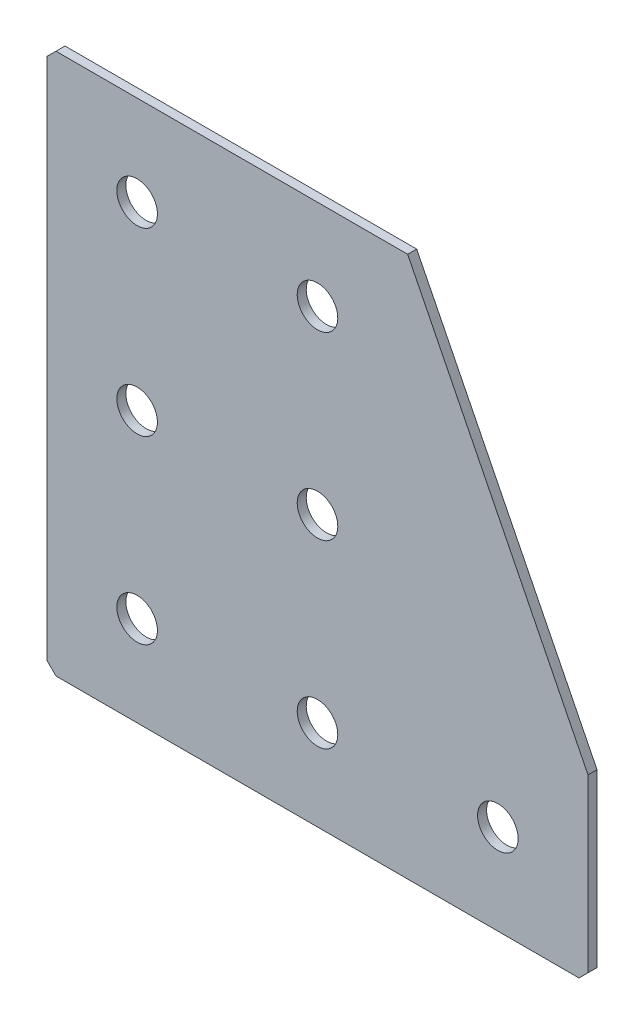
ISO-10303-21;
HEADER;
FILE_DESCRIPTION(('STEP AP214'),'2;1');
FILE_NAME('part.step','',(''),(''),'','','');
FILE_SCHEMA(('AUTOMOTIVE_DESIGN { 1 0 10303 214 1 1 1 1 }'));
ENDSEC;
DATA;
#1=APPLICATION_CONTEXT('core data for automotive mechanical design processes');
#2=APPLICATION_PROTOCOL_DEFINITION('international standard','automotive_design',2000,#1);
#3=PRODUCT_CONTEXT('',#1,'mechanical');
#4=PRODUCT('Part','Part','',(#3));
#5=PRODUCT_RELATED_PRODUCT_CATEGORY('part','',(#4));
#6=PRODUCT_DEFINITION_FORMATION('','',#4);
#7=PRODUCT_DEFINITION_CONTEXT('part definition',#1,'design');
#8=PRODUCT_DEFINITION('design','',#6,#7);
#9=PRODUCT_DEFINITION_SHAPE('','',#8);
#10=(LENGTH_UNIT() NAMED_UNIT(*) SI_UNIT(.MILLI.,.METRE.));
#11=(NAMED_UNIT(*) PLANE_ANGLE_UNIT() SI_UNIT($,.RADIAN.));
#12=(NAMED_UNIT(*) SI_UNIT($,.STERADIAN.) SOLID_ANGLE_UNIT());
#13=UNCERTAINTY_MEASURE_WITH_UNIT(LENGTH_MEASURE(1.E-05),#10,'distance_accuracy_value','');
#14=(GEOMETRIC_REPRESENTATION_CONTEXT(3) GLOBAL_UNCERTAINTY_ASSIGNED_CONTEXT((#13)) GLOBAL_UNIT_ASSIGNED_CONTEXT((#10,
#11,#12)) REPRESENTATION_CONTEXT('',''));
#15=CARTESIAN_POINT('',(0.,0.,0.));
#16=DIRECTION('',(0.,0.,1.));
#17=DIRECTION('',(1.,0.,0.));
#18=AXIS2_PLACEMENT_3D('',#15,#16,#17);
#19=CARTESIAN_POINT('',(80.,0.,-2.));
#20=DIRECTION('',(0.,-1.,0.));
#21=DIRECTION('',(1.,0.,0.));
#22=AXIS2_PLACEMENT_3D('',#19,#20,#21);
#23=PLANE('',#22);
#24=DIRECTION('',(1.,0.,0.));
#25=VECTOR('',#24,1.);
#26=CARTESIAN_POINT('',(80.,0.,-2.));
#27=LINE('',#26,#25);
#28=CARTESIAN_POINT('',(2.,0.,-2.));
#29=VERTEX_POINT('',#28);
#30=CARTESIAN_POINT('',(80.,0.,-2.));
#31=VERTEX_POINT('',#30);
#32=EDGE_CURVE('E101',#29,#31,#27,.T.);
#33=ORIENTED_EDGE('',*,*,#32,.F.);
#34=DIRECTION('',(0.,0.,1.));
#35=VECTOR('',#34,1.);
#36=CARTESIAN_POINT('',(2.,0.,-2.));
#37=LINE('',#36,#35);
#38=CARTESIAN_POINT('',(2.,0.,0.));
#39=VERTEX_POINT('',#38);
#40=EDGE_CURVE('E127',#29,#39,#37,.T.);
#41=ORIENTED_EDGE('',*,*,#40,.T.);
#42=DIRECTION('',(1.,0.,0.));
#43=VECTOR('',#42,1.);
#44=CARTESIAN_POINT('',(80.,0.,0.));
#45=LINE('',#44,#43);
#46=CARTESIAN_POINT('',(80.,0.,0.));
#47=VERTEX_POINT('',#46);
#48=EDGE_CURVE('E125',#39,#47,#45,.T.);
#49=ORIENTED_EDGE('',*,*,#48,.T.);
#50=DIRECTION('',(0.,0.,1.));
#51=VECTOR('',#50,1.);
#52=CARTESIAN_POINT('',(80.,0.,-2.));
#53=LINE('',#52,#51);
#54=EDGE_CURVE('E118',#31,#47,#53,.T.);
#55=ORIENTED_EDGE('',*,*,#54,.F.);
#56=EDGE_LOOP('',(#33,#41,#49,#55));
#57=FACE_BOUND('',#56,.T.);
#58=ADVANCED_FACE('F37',(#57),#23,.F.);
#59=CARTESIAN_POINT('',(120.,-80.,-2.));
#60=DIRECTION('',(-0.894427190999916,-0.447213595499958,0.));
#61=DIRECTION('',(0.447213595499958,-0.894427190999916,0.));
#62=AXIS2_PLACEMENT_3D('',#59,#60,#61);
#63=PLANE('',#62);
#64=DIRECTION('',(0.447213595499958,-0.894427190999916,0.));
#65=VECTOR('',#64,1.);
#66=CARTESIAN_POINT('',(120.,-80.,0.));
#67=LINE('',#66,#65);
#68=CARTESIAN_POINT('',(120.,-80.,0.));
#69=VERTEX_POINT('',#68);
#70=EDGE_CURVE('E164',#47,#69,#67,.T.);
#71=ORIENTED_EDGE('',*,*,#70,.T.);
#72=DIRECTION('',(0.,0.,1.));
#73=VECTOR('',#72,1.);
#74=CARTESIAN_POINT('',(120.,-80.,-2.));
#75=LINE('',#74,#73);
#76=CARTESIAN_POINT('',(120.,-80.,-2.));
#77=VERTEX_POINT('',#76);
#78=EDGE_CURVE('E120',#77,#69,#75,.T.);
#79=ORIENTED_EDGE('',*,*,#78,.F.);
#80=DIRECTION('',(0.447213595499958,-0.894427190999916,0.));
#81=VECTOR('',#80,1.);
#82=CARTESIAN_POINT('',(120.,-80.,-2.));
#83=LINE('',#82,#81);
#84=EDGE_CURVE('E105',#31,#77,#83,.T.);
#85=ORIENTED_EDGE('',*,*,#84,.F.);
#86=ORIENTED_EDGE('',*,*,#54,.T.);
#87=EDGE_LOOP('',(#71,#79,#85,#86));
#88=FACE_BOUND('',#87,.T.);
#89=ADVANCED_FACE('F117',(#88),#63,.F.);
#90=CARTESIAN_POINT('',(120.,-120.,-2.));
#91=DIRECTION('',(-1.,0.,0.));
#92=DIRECTION('',(0.,0.,1.));
#93=AXIS2_PLACEMENT_3D('',#90,#91,#92);
#94=PLANE('',#93);
#95=DIRECTION('',(0.,-1.,0.));
#96=VECTOR('',#95,1.);
#97=CARTESIAN_POINT('',(120.,-120.,0.));
#98=LINE('',#97,#96);
#99=CARTESIAN_POINT('',(120.,-118.,0.));
#100=VERTEX_POINT('',#99);
#101=EDGE_CURVE('E161',#69,#100,#98,.T.);
#102=ORIENTED_EDGE('',*,*,#101,.T.);
#103=DIRECTION('',(0.,0.,-1.));
#104=VECTOR('',#103,1.);
#105=CARTESIAN_POINT('',(120.,-118.,-2.));
#106=LINE('',#105,#104);
#107=CARTESIAN_POINT('',(120.,-118.,-2.));
#108=VERTEX_POINT('',#107);
#109=EDGE_CURVE('E11',#100,#108,#106,.T.);
#110=ORIENTED_EDGE('',*,*,#109,.T.);
#111=DIRECTION('',(0.,-1.,0.));
#112=VECTOR('',#111,1.);
#113=CARTESIAN_POINT('',(120.,-120.,-2.));
#114=LINE('',#113,#112);
#115=EDGE_CURVE('E122',#77,#108,#114,.T.);
#116=ORIENTED_EDGE('',*,*,#115,.F.);
#117=ORIENTED_EDGE('',*,*,#78,.T.);
#118=EDGE_LOOP('',(#102,#110,#116,#117));
#119=FACE_BOUND('',#118,.T.);
#120=ADVANCED_FACE('F253',(#119),#94,.F.);
#121=CARTESIAN_POINT('',(0.,-120.,-2.));
#122=DIRECTION('',(0.,1.,0.));
#123=DIRECTION('',(0.,0.,1.));
#124=AXIS2_PLACEMENT_3D('',#121,#122,#123);
#125=PLANE('',#124);
#126=DIRECTION('',(-1.,0.,0.));
#127=VECTOR('',#126,1.);
#128=CARTESIAN_POINT('',(0.,-120.,-2.));
#129=LINE('',#128,#127);
#130=CARTESIAN_POINT('',(118.,-120.,-2.));
#131=VERTEX_POINT('',#130);
#132=CARTESIAN_POINT('',(2.00000000000003,-120.,-2.));
#133=VERTEX_POINT('',#132);
#134=EDGE_CURVE('E154',#131,#133,#129,.T.);
#135=ORIENTED_EDGE('',*,*,#134,.F.);
#136=DIRECTION('',(0.,0.,1.));
#137=VECTOR('',#136,1.);
#138=CARTESIAN_POINT('',(118.,-120.,-2.));
#139=LINE('',#138,#137);
#140=CARTESIAN_POINT('',(118.,-120.,0.));
#141=VERTEX_POINT('',#140);
#142=EDGE_CURVE('E45',#131,#141,#139,.T.);
#143=ORIENTED_EDGE('',*,*,#142,.T.);
#144=DIRECTION('',(-1.,0.,0.));
#145=VECTOR('',#144,1.);
#146=CARTESIAN_POINT('',(0.,-120.,0.));
#147=LINE('',#146,#145);
#148=CARTESIAN_POINT('',(2.00000000000003,-120.,0.));
#149=VERTEX_POINT('',#148);
#150=EDGE_CURVE('E153',#141,#149,#147,.T.);
#151=ORIENTED_EDGE('',*,*,#150,.T.);
#152=DIRECTION('',(0.,0.,-1.));
#153=VECTOR('',#152,1.);
#154=CARTESIAN_POINT('',(2.00000000000003,-120.,-2.));
#155=LINE('',#154,#153);
#156=EDGE_CURVE('E52',#149,#133,#155,.T.);
#157=ORIENTED_EDGE('',*,*,#156,.T.);
#158=EDGE_LOOP('',(#135,#143,#151,#157));
#159=FACE_BOUND('',#158,.T.);
#160=ADVANCED_FACE('F152',(#159),#125,.F.);
#161=CARTESIAN_POINT('',(0.,0.,-2.));
#162=DIRECTION('',(1.,0.,0.));
#163=DIRECTION('',(0.,0.,-1.));
#164=AXIS2_PLACEMENT_3D('',#161,#162,#163);
#165=PLANE('',#164);
#166=DIRECTION('',(0.,1.,0.));
#167=VECTOR('',#166,1.);
#168=CARTESIAN_POINT('',(0.,0.,0.));
#169=LINE('',#168,#167);
#170=CARTESIAN_POINT('',(0.,-118.,0.));
#171=VERTEX_POINT('',#170);
#172=CARTESIAN_POINT('',(0.,-2.00000000000002,0.));
#173=VERTEX_POINT('',#172);
#174=EDGE_CURVE('E113',#171,#173,#169,.T.);
#175=ORIENTED_EDGE('',*,*,#174,.T.);
#176=DIRECTION('',(0.,0.,-1.));
#177=VECTOR('',#176,1.);
#178=CARTESIAN_POINT('',(0.,-2.00000000000002,-2.));
#179=LINE('',#178,#177);
#180=CARTESIAN_POINT('',(0.,-2.00000000000002,-2.));
#181=VERTEX_POINT('',#180);
#182=EDGE_CURVE('E143',#173,#181,#179,.T.);
#183=ORIENTED_EDGE('',*,*,#182,.T.);
#184=DIRECTION('',(0.,1.,0.));
#185=VECTOR('',#184,1.);
#186=CARTESIAN_POINT('',(0.,0.,-2.));
#187=LINE('',#186,#185);
#188=CARTESIAN_POINT('',(0.,-118.,-2.));
#189=VERTEX_POINT('',#188);
#190=EDGE_CURVE('E131',#189,#181,#187,.T.);
#191=ORIENTED_EDGE('',*,*,#190,.F.);
#192=DIRECTION('',(0.,0.,1.));
#193=VECTOR('',#192,1.);
#194=CARTESIAN_POINT('',(0.,-118.,-2.));
#195=LINE('',#194,#193);
#196=EDGE_CURVE('E140',#189,#171,#195,.T.);
#197=ORIENTED_EDGE('',*,*,#196,.T.);
#198=EDGE_LOOP('',(#175,#183,#191,#197));
#199=FACE_BOUND('',#198,.T.);
#200=ADVANCED_FACE('F219',(#199),#165,.F.);
#201=CARTESIAN_POINT('',(0.,0.,-2.));
#202=DIRECTION('',(0.,0.,1.));
#203=DIRECTION('',(1.,0.,0.));
#204=AXIS2_PLACEMENT_3D('',#201,#202,#203);
#205=PLANE('',#204);
#206=CARTESIAN_POINT('',(60.,-100.,-2.00000000000001));
#207=DIRECTION('',(0.,0.,-1.));
#208=DIRECTION('',(0.,1.,0.));
#209=AXIS2_PLACEMENT_3D('',#206,#207,#208);
#210=CIRCLE('',#209,4.5);
#211=CARTESIAN_POINT('',(60.,-95.5,-2.00000000000001));
#212=VERTEX_POINT('',#211);
#213=EDGE_CURVE('E211',#212,#212,#210,.T.);
#214=ORIENTED_EDGE('',*,*,#213,.F.);
#215=EDGE_LOOP('',(#214));
#216=FACE_BOUND('',#215,.T.);
#217=CARTESIAN_POINT('',(20.,-100.,-2.00000000000001));
#218=DIRECTION('',(0.,0.,-1.));
#219=DIRECTION('',(0.,1.,0.));
#220=AXIS2_PLACEMENT_3D('',#217,#218,#219);
#221=CIRCLE('',#220,4.5);
#222=CARTESIAN_POINT('',(20.,-95.5,-2.00000000000001));
#223=VERTEX_POINT('',#222);
#224=EDGE_CURVE('E205',#223,#223,#221,.T.);
#225=ORIENTED_EDGE('',*,*,#224,.F.);
#226=EDGE_LOOP('',(#225));
#227=FACE_BOUND('',#226,.T.);
#228=CARTESIAN_POINT('',(20.,-60.,-2.));
#229=DIRECTION('',(0.,0.,-1.));
#230=DIRECTION('',(0.,1.,0.));
#231=AXIS2_PLACEMENT_3D('',#228,#229,#230);
#232=CIRCLE('',#231,4.5);
#233=CARTESIAN_POINT('',(20.,-55.5,-2.));
#234=VERTEX_POINT('',#233);
#235=EDGE_CURVE('E199',#234,#234,#232,.T.);
#236=ORIENTED_EDGE('',*,*,#235,.F.);
#237=EDGE_LOOP('',(#236));
#238=FACE_BOUND('',#237,.T.);
#239=CARTESIAN_POINT('',(20.,-20.,-2.));
#240=DIRECTION('',(0.,0.,-1.));
#241=DIRECTION('',(0.,1.,0.));
#242=AXIS2_PLACEMENT_3D('',#239,#240,#241);
#243=CIRCLE('',#242,4.5);
#244=CARTESIAN_POINT('',(20.,-15.5,-2.));
#245=VERTEX_POINT('',#244);
#246=EDGE_CURVE('E193',#245,#245,#243,.T.);
#247=ORIENTED_EDGE('',*,*,#246,.F.);
#248=EDGE_LOOP('',(#247));
#249=FACE_BOUND('',#248,.T.);
#250=CARTESIAN_POINT('',(100.,-100.,-2.00000000000001));
#251=DIRECTION('',(0.,0.,-1.));
#252=DIRECTION('',(0.,1.,0.));
#253=AXIS2_PLACEMENT_3D('',#250,#251,#252);
#254=CIRCLE('',#253,4.5);
#255=CARTESIAN_POINT('',(100.,-95.5,-2.00000000000001));
#256=VERTEX_POINT('',#255);
#257=EDGE_CURVE('E187',#256,#256,#254,.T.);
#258=ORIENTED_EDGE('',*,*,#257,.F.);
#259=EDGE_LOOP('',(#258));
#260=FACE_BOUND('',#259,.T.);
#261=CARTESIAN_POINT('',(60.,-60.,-2.));
#262=DIRECTION('',(0.,0.,-1.));
#263=DIRECTION('',(0.,1.,0.));
#264=AXIS2_PLACEMENT_3D('',#261,#262,#263);
#265=CIRCLE('',#264,4.5);
#266=CARTESIAN_POINT('',(60.,-55.5,-2.));
#267=VERTEX_POINT('',#266);
#268=EDGE_CURVE('E181',#267,#267,#265,.T.);
#269=ORIENTED_EDGE('',*,*,#268,.F.);
#270=EDGE_LOOP('',(#269));
#271=FACE_BOUND('',#270,.T.);
#272=CARTESIAN_POINT('',(60.,-20.,-2.));
#273=DIRECTION('',(0.,0.,-1.));
#274=DIRECTION('',(0.,1.,0.));
#275=AXIS2_PLACEMENT_3D('',#272,#273,#274);
#276=CIRCLE('',#275,4.5);
#277=CARTESIAN_POINT('',(60.,-15.5,-2.));
#278=VERTEX_POINT('',#277);
#279=EDGE_CURVE('E175',#278,#278,#276,.T.);
#280=ORIENTED_EDGE('',*,*,#279,.F.);
#281=EDGE_LOOP('',(#280));
#282=FACE_BOUND('',#281,.T.);
#283=ORIENTED_EDGE('',*,*,#190,.T.);
#284=DIRECTION('',(-0.707106781186545,-0.70710678118655,0.));
#285=VECTOR('',#284,1.);
#286=CARTESIAN_POINT('',(2.,0.,-2.));
#287=LINE('',#286,#285);
#288=EDGE_CURVE('E108',#181,#29,#287,.F.);
#289=ORIENTED_EDGE('',*,*,#288,.T.);
#290=ORIENTED_EDGE('',*,*,#32,.T.);
#291=ORIENTED_EDGE('',*,*,#84,.T.);
#292=ORIENTED_EDGE('',*,*,#115,.T.);
#293=DIRECTION('',(0.707106781186543,0.707106781186552,0.));
#294=VECTOR('',#293,1.);
#295=CARTESIAN_POINT('',(118.,-120.,-2.));
#296=LINE('',#295,#294);
#297=EDGE_CURVE('E59',#108,#131,#296,.F.);
#298=ORIENTED_EDGE('',*,*,#297,.T.);
#299=ORIENTED_EDGE('',*,*,#134,.T.);
#300=DIRECTION('',(0.707106781186552,-0.707106781186543,0.));
#301=VECTOR('',#300,1.);
#302=CARTESIAN_POINT('',(0.,-118.,-2.));
#303=LINE('',#302,#301);
#304=EDGE_CURVE('E145',#133,#189,#303,.F.);
#305=ORIENTED_EDGE('',*,*,#304,.T.);
#306=EDGE_LOOP('',(#283,#289,#290,#291,#292,#298,#299,#305));
#307=FACE_BOUND('',#306,.T.);
#308=ADVANCED_FACE('F104',(#216,#227,#238,#249,#260,#271,#282,#307),#205,.F.);
#309=CARTESIAN_POINT('',(0.,0.,0.));
#310=DIRECTION('',(0.,0.,1.));
#311=DIRECTION('',(1.,0.,0.));
#312=AXIS2_PLACEMENT_3D('',#309,#310,#311);
#313=PLANE('',#312);
#314=CARTESIAN_POINT('',(60.,-100.,0.));
#315=DIRECTION('',(0.,0.,-1.));
#316=DIRECTION('',(0.,1.,0.));
#317=AXIS2_PLACEMENT_3D('',#314,#315,#316);
#318=CIRCLE('',#317,4.5);
#319=CARTESIAN_POINT('',(60.,-95.5,0.));
#320=VERTEX_POINT('',#319);
#321=EDGE_CURVE('E208',#320,#320,#318,.T.);
#322=ORIENTED_EDGE('',*,*,#321,.T.);
#323=EDGE_LOOP('',(#322));
#324=FACE_BOUND('',#323,.T.);
#325=CARTESIAN_POINT('',(20.,-100.,0.));
#326=DIRECTION('',(0.,0.,-1.));
#327=DIRECTION('',(0.,1.,0.));
#328=AXIS2_PLACEMENT_3D('',#325,#326,#327);
#329=CIRCLE('',#328,4.5);
#330=CARTESIAN_POINT('',(20.,-95.5,0.));
#331=VERTEX_POINT('',#330);
#332=EDGE_CURVE('E202',#331,#331,#329,.T.);
#333=ORIENTED_EDGE('',*,*,#332,.T.);
#334=EDGE_LOOP('',(#333));
#335=FACE_BOUND('',#334,.T.);
#336=CARTESIAN_POINT('',(20.,-60.,0.));
#337=DIRECTION('',(0.,0.,-1.));
#338=DIRECTION('',(0.,1.,0.));
#339=AXIS2_PLACEMENT_3D('',#336,#337,#338);
#340=CIRCLE('',#339,4.5);
#341=CARTESIAN_POINT('',(20.,-55.5,0.));
#342=VERTEX_POINT('',#341);
#343=EDGE_CURVE('E196',#342,#342,#340,.T.);
#344=ORIENTED_EDGE('',*,*,#343,.T.);
#345=EDGE_LOOP('',(#344));
#346=FACE_BOUND('',#345,.T.);
#347=CARTESIAN_POINT('',(20.,-20.,0.));
#348=DIRECTION('',(0.,0.,-1.));
#349=DIRECTION('',(0.,1.,0.));
#350=AXIS2_PLACEMENT_3D('',#347,#348,#349);
#351=CIRCLE('',#350,4.5);
#352=CARTESIAN_POINT('',(20.,-15.5,0.));
#353=VERTEX_POINT('',#352);
#354=EDGE_CURVE('E190',#353,#353,#351,.T.);
#355=ORIENTED_EDGE('',*,*,#354,.T.);
#356=EDGE_LOOP('',(#355));
#357=FACE_BOUND('',#356,.T.);
#358=CARTESIAN_POINT('',(100.,-100.,0.));
#359=DIRECTION('',(0.,0.,-1.));
#360=DIRECTION('',(0.,1.,0.));
#361=AXIS2_PLACEMENT_3D('',#358,#359,#360);
#362=CIRCLE('',#361,4.5);
#363=CARTESIAN_POINT('',(100.,-95.5,0.));
#364=VERTEX_POINT('',#363);
#365=EDGE_CURVE('E184',#364,#364,#362,.T.);
#366=ORIENTED_EDGE('',*,*,#365,.T.);
#367=EDGE_LOOP('',(#366));
#368=FACE_BOUND('',#367,.T.);
#369=CARTESIAN_POINT('',(60.,-60.,0.));
#370=DIRECTION('',(0.,0.,-1.));
#371=DIRECTION('',(0.,1.,0.));
#372=AXIS2_PLACEMENT_3D('',#369,#370,#371);
#373=CIRCLE('',#372,4.5);
#374=CARTESIAN_POINT('',(60.,-55.5,0.));
#375=VERTEX_POINT('',#374);
#376=EDGE_CURVE('E178',#375,#375,#373,.T.);
#377=ORIENTED_EDGE('',*,*,#376,.T.);
#378=EDGE_LOOP('',(#377));
#379=FACE_BOUND('',#378,.T.);
#380=CARTESIAN_POINT('',(60.,-20.,0.));
#381=DIRECTION('',(0.,0.,-1.));
#382=DIRECTION('',(0.,1.,0.));
#383=AXIS2_PLACEMENT_3D('',#380,#381,#382);
#384=CIRCLE('',#383,4.5);
#385=CARTESIAN_POINT('',(60.,-15.5,0.));
#386=VERTEX_POINT('',#385);
#387=EDGE_CURVE('E169',#386,#386,#384,.T.);
#388=ORIENTED_EDGE('',*,*,#387,.T.);
#389=EDGE_LOOP('',(#388));
#390=FACE_BOUND('',#389,.T.);
#391=ORIENTED_EDGE('',*,*,#48,.F.);
#392=DIRECTION('',(0.707106781186545,0.70710678118655,0.));
#393=VECTOR('',#392,1.);
#394=CARTESIAN_POINT('',(1.00000000000001,-1.,0.));
#395=LINE('',#394,#393);
#396=EDGE_CURVE('E138',#39,#173,#395,.F.);
#397=ORIENTED_EDGE('',*,*,#396,.T.);
#398=ORIENTED_EDGE('',*,*,#174,.F.);
#399=DIRECTION('',(-0.707106781186552,0.707106781186543,0.));
#400=VECTOR('',#399,1.);
#401=CARTESIAN_POINT('',(-59.,-59.0000000000008,0.));
#402=LINE('',#401,#400);
#403=EDGE_CURVE('E129',#171,#149,#402,.F.);
#404=ORIENTED_EDGE('',*,*,#403,.T.);
#405=ORIENTED_EDGE('',*,*,#150,.F.);
#406=DIRECTION('',(-0.707106781186543,-0.707106781186552,0.));
#407=VECTOR('',#406,1.);
#408=CARTESIAN_POINT('',(119.000000000001,-118.999999999999,0.));
#409=LINE('',#408,#407);
#410=EDGE_CURVE('E136',#141,#100,#409,.F.);
#411=ORIENTED_EDGE('',*,*,#410,.T.);
#412=ORIENTED_EDGE('',*,*,#101,.F.);
#413=ORIENTED_EDGE('',*,*,#70,.F.);
#414=EDGE_LOOP('',(#391,#397,#398,#404,#405,#411,#412,#413));
#415=FACE_BOUND('',#414,.T.);
#416=ADVANCED_FACE('F157',(#324,#335,#346,#357,#368,#379,#390,#415),#313,.T.);
#417=CARTESIAN_POINT('',(60.,-20.,-2.));
#418=DIRECTION('',(0.,0.,-1.));
#419=DIRECTION('',(0.,1.,0.));
#420=AXIS2_PLACEMENT_3D('',#417,#418,#419);
#421=CYLINDRICAL_SURFACE('',#420,4.5);
#422=ORIENTED_EDGE('',*,*,#387,.F.);
#423=EDGE_LOOP('',(#422));
#424=FACE_BOUND('',#423,.T.);
#425=ORIENTED_EDGE('',*,*,#279,.T.);
#426=EDGE_LOOP('',(#425));
#427=FACE_BOUND('',#426,.T.);
#428=ADVANCED_FACE('F233',(#424,#427),#421,.F.);
#429=CARTESIAN_POINT('',(60.,-60.,-2.));
#430=DIRECTION('',(0.,0.,-1.));
#431=DIRECTION('',(0.,1.,0.));
#432=AXIS2_PLACEMENT_3D('',#429,#430,#431);
#433=CYLINDRICAL_SURFACE('',#432,4.5);
#434=ORIENTED_EDGE('',*,*,#376,.F.);
#435=EDGE_LOOP('',(#434));
#436=FACE_BOUND('',#435,.T.);
#437=ORIENTED_EDGE('',*,*,#268,.T.);
#438=EDGE_LOOP('',(#437));
#439=FACE_BOUND('',#438,.T.);
#440=ADVANCED_FACE('F235',(#436,#439),#433,.F.);
#441=CARTESIAN_POINT('',(100.,-100.,-2.00000000000001));
#442=DIRECTION('',(0.,0.,-1.));
#443=DIRECTION('',(0.,1.,0.));
#444=AXIS2_PLACEMENT_3D('',#441,#442,#443);
#445=CYLINDRICAL_SURFACE('',#444,4.5);
#446=ORIENTED_EDGE('',*,*,#365,.F.);
#447=EDGE_LOOP('',(#446));
#448=FACE_BOUND('',#447,.T.);
#449=ORIENTED_EDGE('',*,*,#257,.T.);
#450=EDGE_LOOP('',(#449));
#451=FACE_BOUND('',#450,.T.);
#452=ADVANCED_FACE('F242',(#448,#451),#445,.F.);
#453=CARTESIAN_POINT('',(20.,-20.,-2.));
#454=DIRECTION('',(0.,0.,-1.));
#455=DIRECTION('',(0.,1.,0.));
#456=AXIS2_PLACEMENT_3D('',#453,#454,#455);
#457=CYLINDRICAL_SURFACE('',#456,4.5);
#458=ORIENTED_EDGE('',*,*,#354,.F.);
#459=EDGE_LOOP('',(#458));
#460=FACE_BOUND('',#459,.T.);
#461=ORIENTED_EDGE('',*,*,#246,.T.);
#462=EDGE_LOOP('',(#461));
#463=FACE_BOUND('',#462,.T.);
#464=ADVANCED_FACE('F345',(#460,#463),#457,.F.);
#465=CARTESIAN_POINT('',(20.,-60.,-2.));
#466=DIRECTION('',(0.,0.,-1.));
#467=DIRECTION('',(0.,1.,0.));
#468=AXIS2_PLACEMENT_3D('',#465,#466,#467);
#469=CYLINDRICAL_SURFACE('',#468,4.5);
#470=ORIENTED_EDGE('',*,*,#343,.F.);
#471=EDGE_LOOP('',(#470));
#472=FACE_BOUND('',#471,.T.);
#473=ORIENTED_EDGE('',*,*,#235,.T.);
#474=EDGE_LOOP('',(#473));
#475=FACE_BOUND('',#474,.T.);
#476=ADVANCED_FACE('F337',(#472,#475),#469,.F.);
#477=CARTESIAN_POINT('',(20.,-100.,-2.00000000000001));
#478=DIRECTION('',(0.,0.,-1.));
#479=DIRECTION('',(0.,1.,0.));
#480=AXIS2_PLACEMENT_3D('',#477,#478,#479);
#481=CYLINDRICAL_SURFACE('',#480,4.5);
#482=ORIENTED_EDGE('',*,*,#332,.F.);
#483=EDGE_LOOP('',(#482));
#484=FACE_BOUND('',#483,.T.);
#485=ORIENTED_EDGE('',*,*,#224,.T.);
#486=EDGE_LOOP('',(#485));
#487=FACE_BOUND('',#486,.T.);
#488=ADVANCED_FACE('F330',(#484,#487),#481,.F.);
#489=CARTESIAN_POINT('',(60.,-100.,-2.00000000000001));
#490=DIRECTION('',(0.,0.,-1.));
#491=DIRECTION('',(0.,1.,0.));
#492=AXIS2_PLACEMENT_3D('',#489,#490,#491);
#493=CYLINDRICAL_SURFACE('',#492,4.5);
#494=ORIENTED_EDGE('',*,*,#321,.F.);
#495=EDGE_LOOP('',(#494));
#496=FACE_BOUND('',#495,.T.);
#497=ORIENTED_EDGE('',*,*,#213,.T.);
#498=EDGE_LOOP('',(#497));
#499=FACE_BOUND('',#498,.T.);
#500=ADVANCED_FACE('F215',(#496,#499),#493,.F.);
#501=CARTESIAN_POINT('',(2.,0.,-2.));
#502=DIRECTION('',(0.70710678118655,-0.707106781186545,0.));
#503=DIRECTION('',(0.,0.,1.));
#504=AXIS2_PLACEMENT_3D('',#501,#502,#503);
#505=PLANE('',#504);
#506=ORIENTED_EDGE('',*,*,#288,.F.);
#507=ORIENTED_EDGE('',*,*,#182,.F.);
#508=ORIENTED_EDGE('',*,*,#396,.F.);
#509=ORIENTED_EDGE('',*,*,#40,.F.);
#510=EDGE_LOOP('',(#506,#507,#508,#509));
#511=FACE_BOUND('',#510,.T.);
#512=ADVANCED_FACE('F257',(#511),#505,.F.);
#513=CARTESIAN_POINT('',(118.,-120.,-2.));
#514=DIRECTION('',(-0.707106781186552,0.707106781186542,0.));
#515=DIRECTION('',(0.,0.,1.));
#516=AXIS2_PLACEMENT_3D('',#513,#514,#515);
#517=PLANE('',#516);
#518=ORIENTED_EDGE('',*,*,#297,.F.);
#519=ORIENTED_EDGE('',*,*,#109,.F.);
#520=ORIENTED_EDGE('',*,*,#410,.F.);
#521=ORIENTED_EDGE('',*,*,#142,.F.);
#522=EDGE_LOOP('',(#518,#519,#520,#521));
#523=FACE_BOUND('',#522,.T.);
#524=ADVANCED_FACE('F259',(#523),#517,.F.);
#525=CARTESIAN_POINT('',(0.,-118.,-2.));
#526=DIRECTION('',(0.707106781186542,0.707106781186552,0.));
#527=DIRECTION('',(0.,0.,1.));
#528=AXIS2_PLACEMENT_3D('',#525,#526,#527);
#529=PLANE('',#528);
#530=ORIENTED_EDGE('',*,*,#304,.F.);
#531=ORIENTED_EDGE('',*,*,#156,.F.);
#532=ORIENTED_EDGE('',*,*,#403,.F.);
#533=ORIENTED_EDGE('',*,*,#196,.F.);
#534=EDGE_LOOP('',(#530,#531,#532,#533));
#535=FACE_BOUND('',#534,.T.);
#536=ADVANCED_FACE('F39',(#535),#529,.F.);
#537=CLOSED_SHELL('',(#58,#89,#120,#160,#200,#308,#416,#428,#440,#452,#464,#476,#488,#500,#512,
#524,#536));
#538=MANIFOLD_SOLID_BREP('B2',#537);
#539=ADVANCED_BREP_SHAPE_REPRESENTATION('',(#18,#538),#14);
#540=SHAPE_DEFINITION_REPRESENTATION(#9,#539);
ENDSEC;
END-ISO-10303-21;
